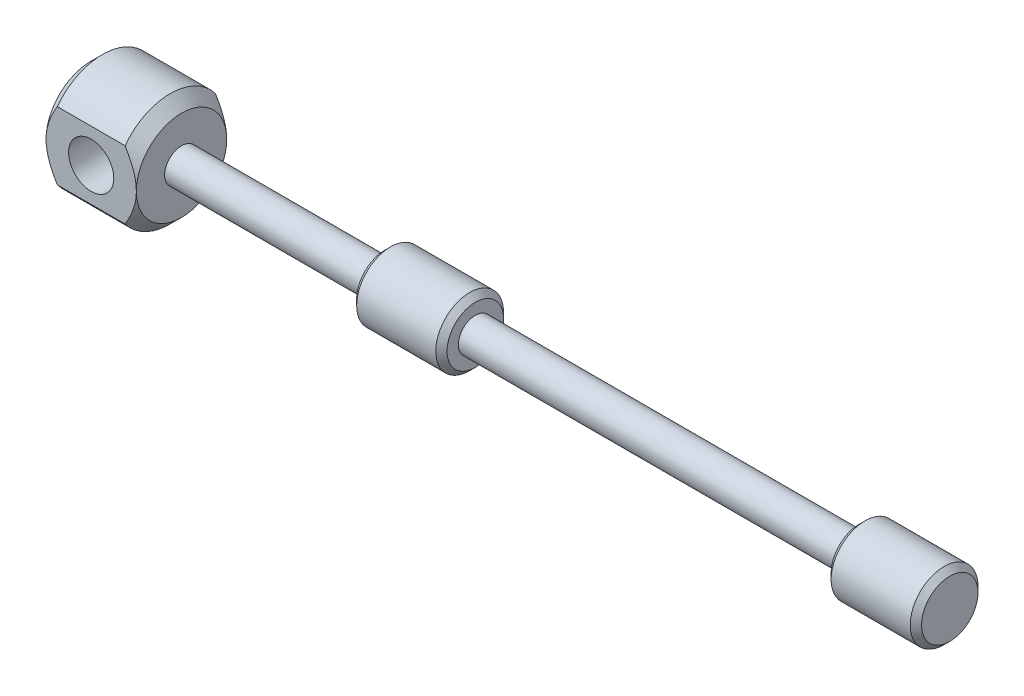
ISO-10303-21;
HEADER;
FILE_DESCRIPTION(('STEP AP214'),'2;1');
FILE_NAME('part.step','',(''),(''),'','','');
FILE_SCHEMA(('AUTOMOTIVE_DESIGN { 1 0 10303 214 1 1 1 1 }'));
ENDSEC;
DATA;
#1=APPLICATION_CONTEXT('core data for automotive mechanical design processes');
#2=APPLICATION_PROTOCOL_DEFINITION('international standard','automotive_design',2000,#1);
#3=PRODUCT_CONTEXT('',#1,'mechanical');
#4=PRODUCT('Part','Part','',(#3));
#5=PRODUCT_RELATED_PRODUCT_CATEGORY('part','',(#4));
#6=PRODUCT_DEFINITION_FORMATION('','',#4);
#7=PRODUCT_DEFINITION_CONTEXT('part definition',#1,'design');
#8=PRODUCT_DEFINITION('design','',#6,#7);
#9=PRODUCT_DEFINITION_SHAPE('','',#8);
#10=(LENGTH_UNIT() NAMED_UNIT(*) SI_UNIT(.MILLI.,.METRE.));
#11=(NAMED_UNIT(*) PLANE_ANGLE_UNIT() SI_UNIT($,.RADIAN.));
#12=(NAMED_UNIT(*) SI_UNIT($,.STERADIAN.) SOLID_ANGLE_UNIT());
#13=UNCERTAINTY_MEASURE_WITH_UNIT(LENGTH_MEASURE(1.E-05),#10,'distance_accuracy_value','');
#14=(GEOMETRIC_REPRESENTATION_CONTEXT(3) GLOBAL_UNCERTAINTY_ASSIGNED_CONTEXT((#13)) GLOBAL_UNIT_ASSIGNED_CONTEXT((#10,
#11,#12)) REPRESENTATION_CONTEXT('',''));
#15=CARTESIAN_POINT('',(0.,0.,0.));
#16=DIRECTION('',(0.,0.,1.));
#17=DIRECTION('',(1.,0.,0.));
#18=AXIS2_PLACEMENT_3D('',#15,#16,#17);
#19=CARTESIAN_POINT('',(-18.,0.,0.));
#20=DIRECTION('',(-1.,0.,0.));
#21=DIRECTION('',(0.,0.,1.));
#22=AXIS2_PLACEMENT_3D('',#19,#20,#21);
#23=CYLINDRICAL_SURFACE('',#22,5.);
#24=DIRECTION('',(-1.,0.,0.));
#25=VECTOR('',#24,1.);
#26=CARTESIAN_POINT('',(-18.,-3.,4.));
#27=LINE('',#26,#25);
#28=CARTESIAN_POINT('',(-25.,-3.,4.));
#29=VERTEX_POINT('',#28);
#30=CARTESIAN_POINT('',(-19.,-3.,4.));
#31=VERTEX_POINT('',#30);
#32=EDGE_CURVE('E195',#29,#31,#27,.F.);
#33=ORIENTED_EDGE('',*,*,#32,.F.);
#34=CARTESIAN_POINT('',(-25.,0.,0.));
#35=DIRECTION('',(-1.,0.,0.));
#36=DIRECTION('',(0.,0.,1.));
#37=AXIS2_PLACEMENT_3D('',#34,#35,#36);
#38=CIRCLE('',#37,5.);
#39=CARTESIAN_POINT('',(-25.,-3.,-4.));
#40=VERTEX_POINT('',#39);
#41=EDGE_CURVE('E125',#29,#40,#38,.F.);
#42=ORIENTED_EDGE('',*,*,#41,.T.);
#43=DIRECTION('',(-1.,0.,0.));
#44=VECTOR('',#43,1.);
#45=CARTESIAN_POINT('',(-18.,-3.,-4.));
#46=LINE('',#45,#44);
#47=CARTESIAN_POINT('',(-19.,-3.,-4.));
#48=VERTEX_POINT('',#47);
#49=EDGE_CURVE('E121',#48,#40,#46,.T.);
#50=ORIENTED_EDGE('',*,*,#49,.F.);
#51=CARTESIAN_POINT('',(-19.,0.,0.));
#52=DIRECTION('',(-1.,0.,0.));
#53=DIRECTION('',(0.,0.,1.));
#54=AXIS2_PLACEMENT_3D('',#51,#52,#53);
#55=CIRCLE('',#54,5.);
#56=EDGE_CURVE('E131',#48,#31,#55,.T.);
#57=ORIENTED_EDGE('',*,*,#56,.T.);
#58=EDGE_LOOP('',(#33,#42,#50,#57));
#59=FACE_BOUND('',#58,.T.);
#60=ADVANCED_FACE('F43',(#59),#23,.T.);
#61=CARTESIAN_POINT('',(-19.,0.,0.));
#62=DIRECTION('',(-1.,0.,0.));
#63=DIRECTION('',(0.,0.,1.));
#64=AXIS2_PLACEMENT_3D('',#61,#62,#63);
#65=CONICAL_SURFACE('',#64,5.,0.78539816339745);
#66=CARTESIAN_POINT('',(-26.7083786113527,-12.0624577482986,4.));
#67=CARTESIAN_POINT('',(-26.5188297905889,-11.8627546869383,4.));
#68=CARTESIAN_POINT('',(-26.3295217080815,-11.6628228735025,4.));
#69=CARTESIAN_POINT('',(-25.9514742317924,-11.2624200659448,4.));
#70=CARTESIAN_POINT('',(-25.7627348415035,-11.0619490685256,4.));
#71=CARTESIAN_POINT('',(-25.1969219126737,-10.4589881443911,4.));
#72=CARTESIAN_POINT('',(-24.8208397845737,-10.055566776886,4.));
#73=CARTESIAN_POINT('',(-24.0508151867542,-9.2220389966232,4.));
#74=CARTESIAN_POINT('',(-23.6570890945255,-8.79173194790588,4.));
#75=CARTESIAN_POINT('',(-23.0714089582689,-8.14242369098127,4.));
#76=CARTESIAN_POINT('',(-22.8771428817277,-7.92550885728903,4.));
#77=CARTESIAN_POINT('',(-22.4905484753912,-7.48996074554231,4.));
#78=CARTESIAN_POINT('',(-22.2982201256968,-7.27132748517601,4.));
#79=CARTESIAN_POINT('',(-21.9164157460658,-6.83237474104771,4.));
#80=CARTESIAN_POINT('',(-21.7269346371567,-6.61205968305024,4.));
#81=CARTESIAN_POINT('',(-21.3511355279373,-6.16871493772407,4.));
#82=CARTESIAN_POINT('',(-21.1648177543667,-5.94568505775477,4.));
#83=CARTESIAN_POINT('',(-20.7955104841441,-5.49506514512524,4.));
#84=CARTESIAN_POINT('',(-20.6125414558073,-5.26745826834511,4.));
#85=CARTESIAN_POINT('',(-20.2524828987245,-4.80770186113664,4.));
#86=CARTESIAN_POINT('',(-20.0753921077954,-4.57555332313911,4.));
#87=CARTESIAN_POINT('',(-19.7343754559407,-4.11182973997455,4.));
#88=CARTESIAN_POINT('',(-19.5702182490867,-3.88042686106083,4.));
#89=CARTESIAN_POINT('',(-19.3324560603645,-3.52740619923417,4.));
#90=CARTESIAN_POINT('',(-19.254570684938,-3.40867456205972,4.));
#91=CARTESIAN_POINT('',(-19.1023331550032,-3.16897373709212,4.));
#92=CARTESIAN_POINT('',(-19.0279807356036,-3.04800471799953,4.));
#93=CARTESIAN_POINT('',(-18.8842200628916,-2.80449264709577,4.));
#94=CARTESIAN_POINT('',(-18.8147757667739,-2.68197111748601,4.));
#95=CARTESIAN_POINT('',(-18.6812169558599,-2.43407010493314,4.));
#96=CARTESIAN_POINT('',(-18.6171033486136,-2.30869013995221,4.));
#97=CARTESIAN_POINT('',(-18.4349291665663,-1.9282499452072,4.));
#98=CARTESIAN_POINT('',(-18.3265917256169,-1.66816723588452,4.));
#99=CARTESIAN_POINT('',(-18.2191247719182,-1.34314416363472,4.));
#100=CARTESIAN_POINT('',(-18.2007813968711,-1.28442357068531,4.));
#101=CARTESIAN_POINT('',(-18.1661993235791,-1.16636535871374,4.));
#102=CARTESIAN_POINT('',(-18.1499605913435,-1.10702774967333,4.));
#103=CARTESIAN_POINT('',(-18.1046366328086,-0.928086236114112,4.));
#104=CARTESIAN_POINT('',(-18.0789566351568,-0.807592301133699,4.));
#105=CARTESIAN_POINT('',(-18.0380217854024,-0.56548422895258,4.));
#106=CARTESIAN_POINT('',(-18.0227127239421,-0.443879337458531,4.));
#107=CARTESIAN_POINT('',(-18.0031394433001,-0.199784405553287,4.));
#108=CARTESIAN_POINT('',(-17.9988735759045,-0.0772944999687434,4.));
#109=CARTESIAN_POINT('',(-18.0016389057871,0.167848695968784,4.));
#110=CARTESIAN_POINT('',(-18.0086971993985,0.290501674447064,4.));
#111=CARTESIAN_POINT('',(-18.033747440004,0.534674536703454,4.));
#112=CARTESIAN_POINT('',(-18.051740045528,0.656194351788074,4.));
#113=CARTESIAN_POINT('',(-18.0978232422,0.897955678626004,4.));
#114=CARTESIAN_POINT('',(-18.1259677950984,1.01818675519311,4.));
#115=CARTESIAN_POINT('',(-18.1910580182415,1.25621830617416,4.));
#116=CARTESIAN_POINT('',(-18.2280042963959,1.37401861209088,4.));
#117=CARTESIAN_POINT('',(-18.314227455947,1.62095994467646,4.));
#118=CARTESIAN_POINT('',(-18.3644515859812,1.74976747194546,4.));
#119=CARTESIAN_POINT('',(-18.4725132394536,2.00415678563646,4.));
#120=CARTESIAN_POINT('',(-18.5303531087453,2.12973756382961,4.));
#121=CARTESIAN_POINT('',(-18.6522625186978,2.37808117662588,4.));
#122=CARTESIAN_POINT('',(-18.7163425332173,2.50083883058347,4.));
#123=CARTESIAN_POINT('',(-18.8494417852055,2.74360867393994,4.));
#124=CARTESIAN_POINT('',(-18.9184603884347,2.86362121327782,4.));
#125=CARTESIAN_POINT('',(-19.0613540684128,3.10267561780306,4.));
#126=CARTESIAN_POINT('',(-19.1352776485702,3.22168835470951,4.));
#127=CARTESIAN_POINT('',(-19.2864566479571,3.45757401085808,4.));
#128=CARTESIAN_POINT('',(-19.3637121458771,3.57444687946963,4.));
#129=CARTESIAN_POINT('',(-19.5208750553998,3.80621965890909,4.));
#130=CARTESIAN_POINT('',(-19.6007797361583,3.92112142685997,4.));
#131=CARTESIAN_POINT('',(-19.7628442949402,4.14931543381093,4.));
#132=CARTESIAN_POINT('',(-19.8450041271492,4.26260770543769,4.));
#133=CARTESIAN_POINT('',(-20.0600993076849,4.55405330424877,4.));
#134=CARTESIAN_POINT('',(-20.1944670942862,4.73114901539809,4.));
#135=CARTESIAN_POINT('',(-20.4668288781397,5.08253610795715,4.));
#136=CARTESIAN_POINT('',(-20.6048231349875,5.25682728716079,4.));
#137=CARTESIAN_POINT('',(-20.8836721496275,5.60316834103965,4.));
#138=CARTESIAN_POINT('',(-21.0245275630072,5.77521768686708,4.));
#139=CARTESIAN_POINT('',(-21.3084933289616,6.11744761107207,4.));
#140=CARTESIAN_POINT('',(-21.4516037323521,6.28762814718928,4.));
#141=CARTESIAN_POINT('',(-21.8840671371319,6.79636946763859,4.));
#142=CARTESIAN_POINT('',(-22.1761369722778,7.13261969048964,4.));
#143=CARTESIAN_POINT('',(-22.7651071722599,7.80075746312115,4.));
#144=CARTESIAN_POINT('',(-23.0620068707926,8.13264560344115,4.));
#145=CARTESIAN_POINT('',(-23.635778285607,8.76727446993551,4.));
#146=CARTESIAN_POINT('',(-23.9123870609033,9.0702532791077,4.));
#147=CARTESIAN_POINT('',(-24.4678393271966,9.67417596353603,4.));
#148=CARTESIAN_POINT('',(-24.7466829109463,9.97511975336563,4.));
#149=CARTESIAN_POINT('',(-25.3052505227485,10.5745218020358,4.));
#150=CARTESIAN_POINT('',(-25.5849694862281,10.8729847855518,4.));
#151=CARTESIAN_POINT('',(-26.1457488871853,11.468613065983,4.));
#152=CARTESIAN_POINT('',(-26.4268092395703,11.7657784429823,4.));
#153=CARTESIAN_POINT('',(-26.7083786113527,12.0624577482986,4.));
#154=B_SPLINE_CURVE_WITH_KNOTS('',3,(#66,#67,#68,#69,#70,#71,#72,#73,#74,#75,#76,#77,#78,#79,
#80,#81,#82,#83,#84,#85,#86,#87,#88,#89,#90,#91,#92,#93,#94,#95,#96,#97,#98,#99,#100,#101,#102,
#103,#104,#105,#106,#107,#108,#109,#110,#111,#112,#113,#114,#115,#116,#117,#118,#119,#120,#121,
#122,#123,#124,#125,#126,#127,#128,#129,#130,#131,#132,#133,#134,#135,#136,#137,#138,#139,#140,
#141,#142,#143,#144,#145,#146,#147,#148,#149,#150,#151,#152,#153),.UNSPECIFIED.,.F.,.F.,(4,2,2,
2,2,2,2,2,2,2,2,2,2,2,2,2,2,2,2,2,2,2,2,2,2,2,2,2,2,2,2,2,2,2,2,2,2,2,2,2,2,2,2,4),(0.,
0.826008831667495,1.65202272622339,3.30660250498125,5.05631577210351,5.92987573731069,
6.80342672249731,7.67516997615031,8.54697545252269,9.42299959235596,10.298834398023,
11.149711499407,11.5756545361928,12.0015655863851,12.4239268279,12.8463598298286,
13.6886904745553,13.8732182156576,14.057742976201,14.426914536783,14.794141215865,
15.1613130826359,15.5293648254607,15.897438736764,16.2674986599569,16.6375841495328,
17.0520374919901,17.4666187972403,17.8819083664013,18.2971446972784,18.7173852210589,
19.137635675168,19.557465627985,19.9772870580984,20.6441217722365,21.3110043515,
21.9780414993579,22.6450937003286,23.9811714943342,25.3170665071073,26.5478146526267,
27.7786141460008,29.0057630179259,30.2328350523182),.UNSPECIFIED.);
#155=CARTESIAN_POINT('',(-18.,0.,4.));
#156=VERTEX_POINT('',#155);
#157=EDGE_CURVE('E194',#31,#156,#154,.T.);
#158=ORIENTED_EDGE('',*,*,#157,.F.);
#159=ORIENTED_EDGE('',*,*,#56,.F.);
#160=CARTESIAN_POINT('',(-26.7083786113527,12.0624577482986,-4.));
#161=CARTESIAN_POINT('',(-26.5188297905889,11.8627546869383,-4.));
#162=CARTESIAN_POINT('',(-26.3295217080815,11.6628228735025,-4.));
#163=CARTESIAN_POINT('',(-25.9514742317924,11.2624200659448,-4.));
#164=CARTESIAN_POINT('',(-25.7627348415035,11.0619490685256,-4.));
#165=CARTESIAN_POINT('',(-25.1969219126737,10.4589881443911,-4.));
#166=CARTESIAN_POINT('',(-24.8208397845737,10.055566776886,-4.));
#167=CARTESIAN_POINT('',(-24.0508151867542,9.2220389966232,-4.));
#168=CARTESIAN_POINT('',(-23.6570890945255,8.79173194790588,-4.));
#169=CARTESIAN_POINT('',(-23.0714089582689,8.14242369098127,-4.));
#170=CARTESIAN_POINT('',(-22.8771428817277,7.92550885728903,-4.));
#171=CARTESIAN_POINT('',(-22.4905484753912,7.48996074554231,-4.));
#172=CARTESIAN_POINT('',(-22.2982201256968,7.27132748517601,-4.));
#173=CARTESIAN_POINT('',(-21.9164157460658,6.83237474104771,-4.));
#174=CARTESIAN_POINT('',(-21.7269346371567,6.61205968305024,-4.));
#175=CARTESIAN_POINT('',(-21.3511355279373,6.16871493772407,-4.));
#176=CARTESIAN_POINT('',(-21.1648177543667,5.94568505775477,-4.));
#177=CARTESIAN_POINT('',(-20.7955104841441,5.49506514512524,-4.));
#178=CARTESIAN_POINT('',(-20.6125414558073,5.26745826834511,-4.));
#179=CARTESIAN_POINT('',(-20.2524828987245,4.80770186113664,-4.));
#180=CARTESIAN_POINT('',(-20.0753921077954,4.57555332313911,-4.));
#181=CARTESIAN_POINT('',(-19.7343754559407,4.11182973997455,-4.));
#182=CARTESIAN_POINT('',(-19.5702182490867,3.88042686106083,-4.));
#183=CARTESIAN_POINT('',(-19.3324560603645,3.52740619923417,-4.));
#184=CARTESIAN_POINT('',(-19.254570684938,3.40867456205972,-4.));
#185=CARTESIAN_POINT('',(-19.1023331550032,3.16897373709212,-4.));
#186=CARTESIAN_POINT('',(-19.0279807356036,3.04800471799953,-4.));
#187=CARTESIAN_POINT('',(-18.8842200628916,2.80449264709577,-4.));
#188=CARTESIAN_POINT('',(-18.8147757667739,2.68197111748601,-4.));
#189=CARTESIAN_POINT('',(-18.6812169558599,2.43407010493314,-4.));
#190=CARTESIAN_POINT('',(-18.6171033486136,2.30869013995221,-4.));
#191=CARTESIAN_POINT('',(-18.4349291665663,1.9282499452072,-4.));
#192=CARTESIAN_POINT('',(-18.3265917256169,1.66816723588452,-4.));
#193=CARTESIAN_POINT('',(-18.2191247719182,1.34314416363472,-4.));
#194=CARTESIAN_POINT('',(-18.2007813968711,1.28442357068531,-4.));
#195=CARTESIAN_POINT('',(-18.1661993235791,1.16636535871374,-4.));
#196=CARTESIAN_POINT('',(-18.1499605913435,1.10702774967333,-4.));
#197=CARTESIAN_POINT('',(-18.1046366328086,0.928086236114112,-4.));
#198=CARTESIAN_POINT('',(-18.0789566351568,0.807592301133699,-4.));
#199=CARTESIAN_POINT('',(-18.0380217854024,0.56548422895258,-4.));
#200=CARTESIAN_POINT('',(-18.0227127239421,0.443879337458531,-4.));
#201=CARTESIAN_POINT('',(-18.0031394433001,0.199784405553287,-4.));
#202=CARTESIAN_POINT('',(-17.9988735759045,0.0772944999687434,-4.));
#203=CARTESIAN_POINT('',(-18.0016389057871,-0.167848695968784,-4.));
#204=CARTESIAN_POINT('',(-18.0086971993985,-0.290501674447064,-4.));
#205=CARTESIAN_POINT('',(-18.033747440004,-0.534674536703454,-4.));
#206=CARTESIAN_POINT('',(-18.051740045528,-0.656194351788074,-4.));
#207=CARTESIAN_POINT('',(-18.0978232422,-0.897955678626004,-4.));
#208=CARTESIAN_POINT('',(-18.1259677950984,-1.01818675519311,-4.));
#209=CARTESIAN_POINT('',(-18.1910580182415,-1.25621830617416,-4.));
#210=CARTESIAN_POINT('',(-18.2280042963959,-1.37401861209088,-4.));
#211=CARTESIAN_POINT('',(-18.314227455947,-1.62095994467646,-4.));
#212=CARTESIAN_POINT('',(-18.3644515859812,-1.74976747194546,-4.));
#213=CARTESIAN_POINT('',(-18.4725132394536,-2.00415678563646,-4.));
#214=CARTESIAN_POINT('',(-18.5303531087453,-2.12973756382961,-4.));
#215=CARTESIAN_POINT('',(-18.6522625186978,-2.37808117662588,-4.));
#216=CARTESIAN_POINT('',(-18.7163425332173,-2.50083883058347,-4.));
#217=CARTESIAN_POINT('',(-18.8494417852055,-2.74360867393994,-4.));
#218=CARTESIAN_POINT('',(-18.9184603884347,-2.86362121327782,-4.));
#219=CARTESIAN_POINT('',(-19.0613540684128,-3.10267561780306,-4.));
#220=CARTESIAN_POINT('',(-19.1352776485702,-3.22168835470951,-4.));
#221=CARTESIAN_POINT('',(-19.2864566479571,-3.45757401085808,-4.));
#222=CARTESIAN_POINT('',(-19.3637121458771,-3.57444687946963,-4.));
#223=CARTESIAN_POINT('',(-19.5208750553998,-3.80621965890909,-4.));
#224=CARTESIAN_POINT('',(-19.6007797361583,-3.92112142685997,-4.));
#225=CARTESIAN_POINT('',(-19.7628442949402,-4.14931543381093,-4.));
#226=CARTESIAN_POINT('',(-19.8450041271492,-4.26260770543769,-4.));
#227=CARTESIAN_POINT('',(-20.0600993076849,-4.55405330424877,-4.));
#228=CARTESIAN_POINT('',(-20.1944670942862,-4.73114901539809,-4.));
#229=CARTESIAN_POINT('',(-20.4668288781397,-5.08253610795715,-4.));
#230=CARTESIAN_POINT('',(-20.6048231349875,-5.25682728716079,-4.));
#231=CARTESIAN_POINT('',(-20.8836721496275,-5.60316834103965,-4.));
#232=CARTESIAN_POINT('',(-21.0245275630072,-5.77521768686708,-4.));
#233=CARTESIAN_POINT('',(-21.3084933289616,-6.11744761107207,-4.));
#234=CARTESIAN_POINT('',(-21.4516037323521,-6.28762814718928,-4.));
#235=CARTESIAN_POINT('',(-21.8840671371319,-6.79636946763859,-4.));
#236=CARTESIAN_POINT('',(-22.1761369722778,-7.13261969048964,-4.));
#237=CARTESIAN_POINT('',(-22.7651071722599,-7.80075746312115,-4.));
#238=CARTESIAN_POINT('',(-23.0620068707926,-8.13264560344115,-4.));
#239=CARTESIAN_POINT('',(-23.635778285607,-8.76727446993551,-4.));
#240=CARTESIAN_POINT('',(-23.9123870609033,-9.0702532791077,-4.));
#241=CARTESIAN_POINT('',(-24.4678393271966,-9.67417596353603,-4.));
#242=CARTESIAN_POINT('',(-24.7466829109463,-9.97511975336563,-4.));
#243=CARTESIAN_POINT('',(-25.3052505227485,-10.5745218020358,-4.));
#244=CARTESIAN_POINT('',(-25.5849694862281,-10.8729847855518,-4.));
#245=CARTESIAN_POINT('',(-26.1457488871853,-11.468613065983,-4.));
#246=CARTESIAN_POINT('',(-26.4268092395703,-11.7657784429823,-4.));
#247=CARTESIAN_POINT('',(-26.7083786113527,-12.0624577482986,-4.));
#248=B_SPLINE_CURVE_WITH_KNOTS('',3,(#160,#161,#162,#163,#164,#165,#166,#167,#168,#169,#170,
#171,#172,#173,#174,#175,#176,#177,#178,#179,#180,#181,#182,#183,#184,#185,#186,#187,#188,#189,
#190,#191,#192,#193,#194,#195,#196,#197,#198,#199,#200,#201,#202,#203,#204,#205,#206,#207,#208,
#209,#210,#211,#212,#213,#214,#215,#216,#217,#218,#219,#220,#221,#222,#223,#224,#225,#226,#227,
#228,#229,#230,#231,#232,#233,#234,#235,#236,#237,#238,#239,#240,#241,#242,#243,#244,#245,#246,
#247),.UNSPECIFIED.,.F.,.F.,(4,2,2,2,2,2,2,2,2,2,2,2,2,2,2,2,2,2,2,2,2,2,2,2,2,2,2,2,2,2,2,2,2,
2,2,2,2,2,2,2,2,2,2,4),(0.,0.826008831667495,1.65202272622339,3.30660250498125,5.05631577210351,
5.92987573731069,6.80342672249731,7.67516997615031,8.54697545252269,9.42299959235596,
10.298834398023,11.149711499407,11.5756545361928,12.0015655863851,12.4239268279,
12.8463598298286,13.6886904745553,13.8732182156576,14.057742976201,14.426914536783,
14.794141215865,15.1613130826359,15.5293648254607,15.897438736764,16.2674986599569,
16.6375841495328,17.0520374919901,17.4666187972403,17.8819083664013,18.2971446972784,
18.7173852210589,19.137635675168,19.557465627985,19.9772870580984,20.6441217722365,
21.3110043515,21.9780414993579,22.6450937003286,23.9811714943342,25.3170665071073,
26.5478146526267,27.7786141460008,29.0057630179259,30.2328350523182),.UNSPECIFIED.);
#249=CARTESIAN_POINT('',(-18.,0.,-4.));
#250=VERTEX_POINT('',#249);
#251=EDGE_CURVE('E120',#250,#48,#248,.T.);
#252=ORIENTED_EDGE('',*,*,#251,.F.);
#253=CARTESIAN_POINT('',(-18.,0.,0.));
#254=DIRECTION('',(-1.,0.,0.));
#255=DIRECTION('',(0.,0.,1.));
#256=AXIS2_PLACEMENT_3D('',#253,#254,#255);
#257=CIRCLE('',#256,3.99999999999998);
#258=EDGE_CURVE('E140',#156,#250,#257,.F.);
#259=ORIENTED_EDGE('',*,*,#258,.F.);
#260=EDGE_LOOP('',(#158,#159,#252,#259));
#261=FACE_BOUND('',#260,.T.);
#262=ADVANCED_FACE('F181',(#261),#65,.T.);
#263=CARTESIAN_POINT('',(-26.,0.,0.));
#264=DIRECTION('',(1.,0.,0.));
#265=DIRECTION('',(0.,0.,-1.));
#266=AXIS2_PLACEMENT_3D('',#263,#264,#265);
#267=CONICAL_SURFACE('',#266,4.,0.78539816339745);
#268=CARTESIAN_POINT('',(-17.2916213886473,12.0624577482986,4.));
#269=CARTESIAN_POINT('',(-17.4811702094111,11.8627546869383,4.));
#270=CARTESIAN_POINT('',(-17.6704782919185,11.6628228735025,4.));
#271=CARTESIAN_POINT('',(-18.0485257682076,11.2624200659448,4.));
#272=CARTESIAN_POINT('',(-18.2372651584965,11.0619490685256,4.));
#273=CARTESIAN_POINT('',(-18.8030780873264,10.4589881443911,4.));
#274=CARTESIAN_POINT('',(-19.1791602154264,10.0555667768859,4.));
#275=CARTESIAN_POINT('',(-19.9491848132459,9.2220389966232,4.));
#276=CARTESIAN_POINT('',(-20.3429109054745,8.79173194790587,4.));
#277=CARTESIAN_POINT('',(-20.9285910417311,8.14242369098126,4.));
#278=CARTESIAN_POINT('',(-21.1228571182724,7.92550885728902,4.));
#279=CARTESIAN_POINT('',(-21.5094515246089,7.4899607455423,4.));
#280=CARTESIAN_POINT('',(-21.7017798743032,7.271327485176,4.));
#281=CARTESIAN_POINT('',(-22.0835842539342,6.8323747410477,4.));
#282=CARTESIAN_POINT('',(-22.2730653628433,6.61205968305023,4.));
#283=CARTESIAN_POINT('',(-22.6488644720627,6.16871493772406,4.));
#284=CARTESIAN_POINT('',(-22.8351822456333,5.94568505775476,4.));
#285=CARTESIAN_POINT('',(-23.204489515856,5.49506514512523,4.));
#286=CARTESIAN_POINT('',(-23.3874585441928,5.2674582683451,4.));
#287=CARTESIAN_POINT('',(-23.7475171012755,4.80770186113663,4.));
#288=CARTESIAN_POINT('',(-23.9246078922046,4.5755533231391,4.));
#289=CARTESIAN_POINT('',(-24.2656245440593,4.11182973997454,4.));
#290=CARTESIAN_POINT('',(-24.4297817509133,3.88042686106083,4.));
#291=CARTESIAN_POINT('',(-24.6675439396355,3.52740619923416,4.));
#292=CARTESIAN_POINT('',(-24.745429315062,3.40867456205971,4.));
#293=CARTESIAN_POINT('',(-24.8976668449968,3.16897373709211,4.));
#294=CARTESIAN_POINT('',(-24.9720192643964,3.04800471799952,4.));
#295=CARTESIAN_POINT('',(-25.1157799371085,2.80449264709576,4.));
#296=CARTESIAN_POINT('',(-25.1852242332261,2.681971117486,4.));
#297=CARTESIAN_POINT('',(-25.3187830441401,2.43407010493312,4.));
#298=CARTESIAN_POINT('',(-25.3828966513864,2.30869013995219,4.));
#299=CARTESIAN_POINT('',(-25.5650708334337,1.92824994520718,4.));
#300=CARTESIAN_POINT('',(-25.6734082743832,1.6681672358845,4.));
#301=CARTESIAN_POINT('',(-25.7808752280818,1.3431441636347,4.));
#302=CARTESIAN_POINT('',(-25.7992186031289,1.2844235706853,4.));
#303=CARTESIAN_POINT('',(-25.8338006764209,1.16636535871372,4.));
#304=CARTESIAN_POINT('',(-25.8500394086565,1.10702774967331,4.));
#305=CARTESIAN_POINT('',(-25.8953633671914,0.928086236114094,4.));
#306=CARTESIAN_POINT('',(-25.9210433648432,0.807592301133681,4.));
#307=CARTESIAN_POINT('',(-25.9619782145976,0.565484228952561,4.));
#308=CARTESIAN_POINT('',(-25.9772872760579,0.443879337458511,4.));
#309=CARTESIAN_POINT('',(-25.9968605567,0.199784405553268,4.));
#310=CARTESIAN_POINT('',(-26.0011264240955,0.0772944999687244,4.));
#311=CARTESIAN_POINT('',(-25.9983610942129,-0.167848695968802,4.));
#312=CARTESIAN_POINT('',(-25.9913028006016,-0.290501674447082,4.));
#313=CARTESIAN_POINT('',(-25.966252559996,-0.53467453670347,4.));
#314=CARTESIAN_POINT('',(-25.948259954472,-0.656194351788091,4.));
#315=CARTESIAN_POINT('',(-25.9021767578,-0.897955678626021,4.));
#316=CARTESIAN_POINT('',(-25.8740322049016,-1.01818675519313,4.));
#317=CARTESIAN_POINT('',(-25.8089419817585,-1.25621830617418,4.));
#318=CARTESIAN_POINT('',(-25.7719957036041,-1.3740186120909,4.));
#319=CARTESIAN_POINT('',(-25.685772544053,-1.62095994467647,4.));
#320=CARTESIAN_POINT('',(-25.6355484140188,-1.74976747194548,4.));
#321=CARTESIAN_POINT('',(-25.5274867605464,-2.00415678563648,4.));
#322=CARTESIAN_POINT('',(-25.4696468912547,-2.12973756382963,4.));
#323=CARTESIAN_POINT('',(-25.3477374813022,-2.37808117662591,4.));
#324=CARTESIAN_POINT('',(-25.2836574667827,-2.5008388305835,4.));
#325=CARTESIAN_POINT('',(-25.1505582147945,-2.74360867393997,4.));
#326=CARTESIAN_POINT('',(-25.0815396115653,-2.86362121327785,4.));
#327=CARTESIAN_POINT('',(-24.9386459315872,-3.10267561780309,4.));
#328=CARTESIAN_POINT('',(-24.8647223514298,-3.22168835470954,4.));
#329=CARTESIAN_POINT('',(-24.7135433520429,-3.45757401085812,4.));
#330=CARTESIAN_POINT('',(-24.6362878541229,-3.57444687946967,4.));
#331=CARTESIAN_POINT('',(-24.4791249446001,-3.80621965890913,4.));
#332=CARTESIAN_POINT('',(-24.3992202638416,-3.92112142686001,4.));
#333=CARTESIAN_POINT('',(-24.2371557050598,-4.14931543381097,4.));
#334=CARTESIAN_POINT('',(-24.1549958728507,-4.26260770543773,4.));
#335=CARTESIAN_POINT('',(-23.9399006923151,-4.55405330424881,4.));
#336=CARTESIAN_POINT('',(-23.8055329057138,-4.73114901539813,4.));
#337=CARTESIAN_POINT('',(-23.5331711218603,-5.08253610795719,4.));
#338=CARTESIAN_POINT('',(-23.3951768650125,-5.25682728716083,4.));
#339=CARTESIAN_POINT('',(-23.1163278503725,-5.60316834103968,4.));
#340=CARTESIAN_POINT('',(-22.9754724369928,-5.77521768686711,4.));
#341=CARTESIAN_POINT('',(-22.6915066710384,-6.1174476110721,4.));
#342=CARTESIAN_POINT('',(-22.5483962676479,-6.28762814718931,4.));
#343=CARTESIAN_POINT('',(-22.1159328628681,-6.79636946763862,4.));
#344=CARTESIAN_POINT('',(-21.8238630277222,-7.13261969048966,4.));
#345=CARTESIAN_POINT('',(-21.2348928277401,-7.80075746312117,4.));
#346=CARTESIAN_POINT('',(-20.9379931292074,-8.13264560344117,4.));
#347=CARTESIAN_POINT('',(-20.364221714393,-8.76727446993552,4.));
#348=CARTESIAN_POINT('',(-20.0876129390967,-9.07025327910771,4.));
#349=CARTESIAN_POINT('',(-19.5321606728034,-9.67417596353604,4.));
#350=CARTESIAN_POINT('',(-19.2533170890537,-9.97511975336564,4.));
#351=CARTESIAN_POINT('',(-18.6947494772515,-10.5745218020358,4.));
#352=CARTESIAN_POINT('',(-18.4150305137719,-10.8729847855518,4.));
#353=CARTESIAN_POINT('',(-17.8542511128147,-11.468613065983,4.));
#354=CARTESIAN_POINT('',(-17.5731907604297,-11.7657784429823,4.));
#355=CARTESIAN_POINT('',(-17.2916213886473,-12.0624577482986,4.));
#356=B_SPLINE_CURVE_WITH_KNOTS('',3,(#268,#269,#270,#271,#272,#273,#274,#275,#276,#277,#278,
#279,#280,#281,#282,#283,#284,#285,#286,#287,#288,#289,#290,#291,#292,#293,#294,#295,#296,#297,
#298,#299,#300,#301,#302,#303,#304,#305,#306,#307,#308,#309,#310,#311,#312,#313,#314,#315,#316,
#317,#318,#319,#320,#321,#322,#323,#324,#325,#326,#327,#328,#329,#330,#331,#332,#333,#334,#335,
#336,#337,#338,#339,#340,#341,#342,#343,#344,#345,#346,#347,#348,#349,#350,#351,#352,#353,#354,
#355),.UNSPECIFIED.,.F.,.F.,(4,2,2,2,2,2,2,2,2,2,2,2,2,2,2,2,2,2,2,2,2,2,2,2,2,2,2,2,2,2,2,2,2,
2,2,2,2,2,2,2,2,2,2,4),(0.,0.826008831667496,1.65202272622339,3.30660250498125,5.05631577210352,
5.9298757373107,6.80342672249732,7.67516997615032,8.5469754525227,9.42299959235597,
10.298834398023,11.149711499407,11.5756545361928,12.0015655863851,12.4239268279001,
12.8463598298286,13.6886904745553,13.8732182156576,14.057742976201,14.426914536783,
14.794141215865,15.1613130826359,15.5293648254607,15.897438736764,16.2674986599569,
16.6375841495328,17.0520374919901,17.4666187972404,17.8819083664013,18.2971446972785,
18.7173852210589,19.137635675168,19.557465627985,19.9772870580984,20.6441217722365,
21.3110043515001,21.9780414993579,22.6450937003286,23.9811714943342,25.3170665071074,
26.5478146526267,27.7786141460008,29.0057630179259,30.2328350523182),.UNSPECIFIED.);
#357=CARTESIAN_POINT('',(-25.,3.,4.));
#358=VERTEX_POINT('',#357);
#359=CARTESIAN_POINT('',(-26.,0.,4.));
#360=VERTEX_POINT('',#359);
#361=EDGE_CURVE('E11',#358,#360,#356,.T.);
#362=ORIENTED_EDGE('',*,*,#361,.F.);
#363=CARTESIAN_POINT('',(-25.,3.,-4.));
#364=VERTEX_POINT('',#363);
#365=EDGE_CURVE('E116',#364,#358,#38,.F.);
#366=ORIENTED_EDGE('',*,*,#365,.F.);
#367=CARTESIAN_POINT('',(-17.2916213886473,-12.0624577482986,-4.));
#368=CARTESIAN_POINT('',(-17.4811702094111,-11.8627546869383,-4.));
#369=CARTESIAN_POINT('',(-17.6704782919185,-11.6628228735025,-4.));
#370=CARTESIAN_POINT('',(-18.0485257682076,-11.2624200659448,-4.));
#371=CARTESIAN_POINT('',(-18.2372651584965,-11.0619490685256,-4.));
#372=CARTESIAN_POINT('',(-18.8030780873264,-10.4589881443911,-4.));
#373=CARTESIAN_POINT('',(-19.1791602154264,-10.0555667768859,-4.));
#374=CARTESIAN_POINT('',(-19.9491848132459,-9.2220389966232,-4.));
#375=CARTESIAN_POINT('',(-20.3429109054745,-8.79173194790587,-4.));
#376=CARTESIAN_POINT('',(-20.9285910417311,-8.14242369098126,-4.));
#377=CARTESIAN_POINT('',(-21.1228571182724,-7.92550885728902,-4.));
#378=CARTESIAN_POINT('',(-21.5094515246089,-7.4899607455423,-4.));
#379=CARTESIAN_POINT('',(-21.7017798743032,-7.271327485176,-4.));
#380=CARTESIAN_POINT('',(-22.0835842539342,-6.8323747410477,-4.));
#381=CARTESIAN_POINT('',(-22.2730653628433,-6.61205968305023,-4.));
#382=CARTESIAN_POINT('',(-22.6488644720627,-6.16871493772406,-4.));
#383=CARTESIAN_POINT('',(-22.8351822456333,-5.94568505775476,-4.));
#384=CARTESIAN_POINT('',(-23.204489515856,-5.49506514512523,-4.));
#385=CARTESIAN_POINT('',(-23.3874585441928,-5.2674582683451,-4.));
#386=CARTESIAN_POINT('',(-23.7475171012755,-4.80770186113663,-4.));
#387=CARTESIAN_POINT('',(-23.9246078922046,-4.5755533231391,-4.));
#388=CARTESIAN_POINT('',(-24.2656245440593,-4.11182973997454,-4.));
#389=CARTESIAN_POINT('',(-24.4297817509133,-3.88042686106083,-4.));
#390=CARTESIAN_POINT('',(-24.6675439396355,-3.52740619923416,-4.));
#391=CARTESIAN_POINT('',(-24.745429315062,-3.40867456205971,-4.));
#392=CARTESIAN_POINT('',(-24.8976668449968,-3.16897373709211,-4.));
#393=CARTESIAN_POINT('',(-24.9720192643964,-3.04800471799952,-4.));
#394=CARTESIAN_POINT('',(-25.1157799371085,-2.80449264709576,-4.));
#395=CARTESIAN_POINT('',(-25.1852242332261,-2.681971117486,-4.));
#396=CARTESIAN_POINT('',(-25.3187830441401,-2.43407010493312,-4.));
#397=CARTESIAN_POINT('',(-25.3828966513864,-2.30869013995219,-4.));
#398=CARTESIAN_POINT('',(-25.5650708334337,-1.92824994520718,-4.));
#399=CARTESIAN_POINT('',(-25.6734082743832,-1.6681672358845,-4.));
#400=CARTESIAN_POINT('',(-25.7808752280818,-1.3431441636347,-4.));
#401=CARTESIAN_POINT('',(-25.7992186031289,-1.2844235706853,-4.));
#402=CARTESIAN_POINT('',(-25.8338006764209,-1.16636535871372,-4.));
#403=CARTESIAN_POINT('',(-25.8500394086565,-1.10702774967331,-4.));
#404=CARTESIAN_POINT('',(-25.8953633671914,-0.928086236114094,-4.));
#405=CARTESIAN_POINT('',(-25.9210433648432,-0.807592301133681,-4.));
#406=CARTESIAN_POINT('',(-25.9619782145976,-0.565484228952561,-4.));
#407=CARTESIAN_POINT('',(-25.9772872760579,-0.443879337458511,-4.));
#408=CARTESIAN_POINT('',(-25.9968605567,-0.199784405553268,-4.));
#409=CARTESIAN_POINT('',(-26.0011264240955,-0.0772944999687244,-4.));
#410=CARTESIAN_POINT('',(-25.9983610942129,0.167848695968802,-4.));
#411=CARTESIAN_POINT('',(-25.9913028006016,0.290501674447082,-4.));
#412=CARTESIAN_POINT('',(-25.966252559996,0.53467453670347,-4.));
#413=CARTESIAN_POINT('',(-25.948259954472,0.656194351788091,-4.));
#414=CARTESIAN_POINT('',(-25.9021767578,0.897955678626021,-4.));
#415=CARTESIAN_POINT('',(-25.8740322049016,1.01818675519313,-4.));
#416=CARTESIAN_POINT('',(-25.8089419817585,1.25621830617418,-4.));
#417=CARTESIAN_POINT('',(-25.7719957036041,1.3740186120909,-4.));
#418=CARTESIAN_POINT('',(-25.685772544053,1.62095994467647,-4.));
#419=CARTESIAN_POINT('',(-25.6355484140188,1.74976747194548,-4.));
#420=CARTESIAN_POINT('',(-25.5274867605464,2.00415678563648,-4.));
#421=CARTESIAN_POINT('',(-25.4696468912547,2.12973756382963,-4.));
#422=CARTESIAN_POINT('',(-25.3477374813022,2.37808117662591,-4.));
#423=CARTESIAN_POINT('',(-25.2836574667827,2.5008388305835,-4.));
#424=CARTESIAN_POINT('',(-25.1505582147945,2.74360867393997,-4.));
#425=CARTESIAN_POINT('',(-25.0815396115653,2.86362121327785,-4.));
#426=CARTESIAN_POINT('',(-24.9386459315872,3.10267561780309,-4.));
#427=CARTESIAN_POINT('',(-24.8647223514298,3.22168835470954,-4.));
#428=CARTESIAN_POINT('',(-24.7135433520429,3.45757401085812,-4.));
#429=CARTESIAN_POINT('',(-24.6362878541229,3.57444687946967,-4.));
#430=CARTESIAN_POINT('',(-24.4791249446001,3.80621965890913,-4.));
#431=CARTESIAN_POINT('',(-24.3992202638416,3.92112142686001,-4.));
#432=CARTESIAN_POINT('',(-24.2371557050598,4.14931543381097,-4.));
#433=CARTESIAN_POINT('',(-24.1549958728507,4.26260770543773,-4.));
#434=CARTESIAN_POINT('',(-23.9399006923151,4.55405330424881,-4.));
#435=CARTESIAN_POINT('',(-23.8055329057138,4.73114901539813,-4.));
#436=CARTESIAN_POINT('',(-23.5331711218603,5.08253610795719,-4.));
#437=CARTESIAN_POINT('',(-23.3951768650125,5.25682728716083,-4.));
#438=CARTESIAN_POINT('',(-23.1163278503725,5.60316834103968,-4.));
#439=CARTESIAN_POINT('',(-22.9754724369928,5.77521768686711,-4.));
#440=CARTESIAN_POINT('',(-22.6915066710384,6.1174476110721,-4.));
#441=CARTESIAN_POINT('',(-22.5483962676479,6.28762814718931,-4.));
#442=CARTESIAN_POINT('',(-22.1159328628681,6.79636946763862,-4.));
#443=CARTESIAN_POINT('',(-21.8238630277222,7.13261969048966,-4.));
#444=CARTESIAN_POINT('',(-21.2348928277401,7.80075746312117,-4.));
#445=CARTESIAN_POINT('',(-20.9379931292074,8.13264560344117,-4.));
#446=CARTESIAN_POINT('',(-20.364221714393,8.76727446993552,-4.));
#447=CARTESIAN_POINT('',(-20.0876129390967,9.07025327910771,-4.));
#448=CARTESIAN_POINT('',(-19.5321606728034,9.67417596353604,-4.));
#449=CARTESIAN_POINT('',(-19.2533170890537,9.97511975336564,-4.));
#450=CARTESIAN_POINT('',(-18.6947494772515,10.5745218020358,-4.));
#451=CARTESIAN_POINT('',(-18.4150305137719,10.8729847855518,-4.));
#452=CARTESIAN_POINT('',(-17.8542511128147,11.468613065983,-4.));
#453=CARTESIAN_POINT('',(-17.5731907604297,11.7657784429823,-4.));
#454=CARTESIAN_POINT('',(-17.2916213886473,12.0624577482986,-4.));
#455=B_SPLINE_CURVE_WITH_KNOTS('',3,(#367,#368,#369,#370,#371,#372,#373,#374,#375,#376,#377,
#378,#379,#380,#381,#382,#383,#384,#385,#386,#387,#388,#389,#390,#391,#392,#393,#394,#395,#396,
#397,#398,#399,#400,#401,#402,#403,#404,#405,#406,#407,#408,#409,#410,#411,#412,#413,#414,#415,
#416,#417,#418,#419,#420,#421,#422,#423,#424,#425,#426,#427,#428,#429,#430,#431,#432,#433,#434,
#435,#436,#437,#438,#439,#440,#441,#442,#443,#444,#445,#446,#447,#448,#449,#450,#451,#452,#453,
#454),.UNSPECIFIED.,.F.,.F.,(4,2,2,2,2,2,2,2,2,2,2,2,2,2,2,2,2,2,2,2,2,2,2,2,2,2,2,2,2,2,2,2,2,
2,2,2,2,2,2,2,2,2,2,4),(0.,0.826008831667496,1.65202272622339,3.30660250498125,5.05631577210352,
5.9298757373107,6.80342672249732,7.67516997615032,8.5469754525227,9.42299959235597,
10.298834398023,11.149711499407,11.5756545361928,12.0015655863851,12.4239268279001,
12.8463598298286,13.6886904745553,13.8732182156576,14.057742976201,14.426914536783,
14.794141215865,15.1613130826359,15.5293648254607,15.897438736764,16.2674986599569,
16.6375841495328,17.0520374919901,17.4666187972404,17.8819083664013,18.2971446972785,
18.7173852210589,19.137635675168,19.557465627985,19.9772870580984,20.6441217722365,
21.3110043515001,21.9780414993579,22.6450937003286,23.9811714943342,25.3170665071074,
26.5478146526267,27.7786141460008,29.0057630179259,30.2328350523182),.UNSPECIFIED.);
#456=CARTESIAN_POINT('',(-26.,0.,-4.));
#457=VERTEX_POINT('',#456);
#458=EDGE_CURVE('E99',#457,#364,#455,.T.);
#459=ORIENTED_EDGE('',*,*,#458,.F.);
#460=CARTESIAN_POINT('',(-26.,0.,0.));
#461=DIRECTION('',(-1.,0.,0.));
#462=DIRECTION('',(0.,0.,1.));
#463=AXIS2_PLACEMENT_3D('',#460,#461,#462);
#464=CIRCLE('',#463,4.);
#465=EDGE_CURVE('E110',#360,#457,#464,.T.);
#466=ORIENTED_EDGE('',*,*,#465,.F.);
#467=EDGE_LOOP('',(#362,#366,#459,#466));
#468=FACE_BOUND('',#467,.T.);
#469=ADVANCED_FACE('F123',(#468),#267,.T.);
#470=CARTESIAN_POINT('',(-26.,0.,0.));
#471=DIRECTION('',(1.,0.,0.));
#472=DIRECTION('',(0.,0.,-1.));
#473=AXIS2_PLACEMENT_3D('',#470,#471,#472);
#474=CYLINDRICAL_SURFACE('',#473,1.5);
#475=CARTESIAN_POINT('',(0.,0.,0.));
#476=DIRECTION('',(-1.,0.,0.));
#477=DIRECTION('',(0.,0.,1.));
#478=AXIS2_PLACEMENT_3D('',#475,#476,#477);
#479=CIRCLE('',#478,1.5);
#480=CARTESIAN_POINT('',(0.,0.,1.5));
#481=VERTEX_POINT('',#480);
#482=EDGE_CURVE('E133',#481,#481,#479,.T.);
#483=ORIENTED_EDGE('',*,*,#482,.T.);
#484=EDGE_LOOP('',(#483));
#485=FACE_BOUND('',#484,.T.);
#486=CARTESIAN_POINT('',(-18.,0.,0.));
#487=DIRECTION('',(-1.,0.,0.));
#488=DIRECTION('',(0.,0.,1.));
#489=AXIS2_PLACEMENT_3D('',#486,#487,#488);
#490=CIRCLE('',#489,1.5);
#491=CARTESIAN_POINT('',(-18.,0.,1.5));
#492=VERTEX_POINT('',#491);
#493=EDGE_CURVE('E126',#492,#492,#490,.T.);
#494=ORIENTED_EDGE('',*,*,#493,.F.);
#495=EDGE_LOOP('',(#494));
#496=FACE_BOUND('',#495,.T.);
#497=ADVANCED_FACE('F267',(#485,#496),#474,.T.);
#498=CARTESIAN_POINT('',(50.,0.,0.));
#499=DIRECTION('',(-1.,0.,0.));
#500=DIRECTION('',(0.,0.,1.));
#501=AXIS2_PLACEMENT_3D('',#498,#499,#500);
#502=CYLINDRICAL_SURFACE('',#501,1.5);
#503=CARTESIAN_POINT('',(42.,0.,0.));
#504=DIRECTION('',(1.,0.,0.));
#505=DIRECTION('',(0.,0.,-1.));
#506=AXIS2_PLACEMENT_3D('',#503,#504,#505);
#507=CIRCLE('',#506,1.5);
#508=CARTESIAN_POINT('',(42.,0.,-1.5));
#509=VERTEX_POINT('',#508);
#510=EDGE_CURVE('E200',#509,#509,#507,.T.);
#511=ORIENTED_EDGE('',*,*,#510,.F.);
#512=EDGE_LOOP('',(#511));
#513=FACE_BOUND('',#512,.T.);
#514=CARTESIAN_POINT('',(8.,0.,0.));
#515=DIRECTION('',(-1.,0.,0.));
#516=DIRECTION('',(0.,0.,1.));
#517=AXIS2_PLACEMENT_3D('',#514,#515,#516);
#518=CIRCLE('',#517,1.5);
#519=CARTESIAN_POINT('',(8.,0.,1.5));
#520=VERTEX_POINT('',#519);
#521=EDGE_CURVE('E224',#520,#520,#518,.T.);
#522=ORIENTED_EDGE('',*,*,#521,.F.);
#523=EDGE_LOOP('',(#522));
#524=FACE_BOUND('',#523,.T.);
#525=ADVANCED_FACE('F270',(#513,#524),#502,.T.);
#526=CARTESIAN_POINT('',(42.,0.,0.));
#527=DIRECTION('',(1.,0.,0.));
#528=DIRECTION('',(0.,0.,-1.));
#529=AXIS2_PLACEMENT_3D('',#526,#527,#528);
#530=CYLINDRICAL_SURFACE('',#529,3.);
#531=CARTESIAN_POINT('',(42.5,0.,0.));
#532=DIRECTION('',(1.,0.,0.));
#533=DIRECTION('',(0.,0.,-1.));
#534=AXIS2_PLACEMENT_3D('',#531,#532,#533);
#535=CIRCLE('',#534,3.);
#536=CARTESIAN_POINT('',(42.5,0.,-3.));
#537=VERTEX_POINT('',#536);
#538=EDGE_CURVE('E212',#537,#537,#535,.T.);
#539=ORIENTED_EDGE('',*,*,#538,.T.);
#540=EDGE_LOOP('',(#539));
#541=FACE_BOUND('',#540,.T.);
#542=CARTESIAN_POINT('',(49.5,0.,0.));
#543=DIRECTION('',(1.,0.,0.));
#544=DIRECTION('',(0.,0.,-1.));
#545=AXIS2_PLACEMENT_3D('',#542,#543,#544);
#546=CIRCLE('',#545,3.);
#547=CARTESIAN_POINT('',(49.5,0.,-3.));
#548=VERTEX_POINT('',#547);
#549=EDGE_CURVE('E208',#548,#548,#546,.F.);
#550=ORIENTED_EDGE('',*,*,#549,.T.);
#551=EDGE_LOOP('',(#550));
#552=FACE_BOUND('',#551,.T.);
#553=ADVANCED_FACE('F285',(#541,#552),#530,.T.);
#554=CARTESIAN_POINT('',(42.,0.,0.));
#555=DIRECTION('',(1.,0.,0.));
#556=DIRECTION('',(0.,0.,-1.));
#557=AXIS2_PLACEMENT_3D('',#554,#555,#556);
#558=PLANE('',#557);
#559=CARTESIAN_POINT('',(42.,0.,0.));
#560=DIRECTION('',(1.,0.,0.));
#561=DIRECTION('',(0.,0.,-1.));
#562=AXIS2_PLACEMENT_3D('',#559,#560,#561);
#563=CIRCLE('',#562,2.5);
#564=CARTESIAN_POINT('',(42.,0.,-2.5));
#565=VERTEX_POINT('',#564);
#566=EDGE_CURVE('E216',#565,#565,#563,.F.);
#567=ORIENTED_EDGE('',*,*,#566,.T.);
#568=EDGE_LOOP('',(#567));
#569=FACE_BOUND('',#568,.T.);
#570=ORIENTED_EDGE('',*,*,#510,.T.);
#571=EDGE_LOOP('',(#570));
#572=FACE_BOUND('',#571,.T.);
#573=ADVANCED_FACE('F281',(#569,#572),#558,.F.);
#574=CARTESIAN_POINT('',(50.,0.,0.));
#575=DIRECTION('',(1.,0.,0.));
#576=DIRECTION('',(0.,0.,-1.));
#577=AXIS2_PLACEMENT_3D('',#574,#575,#576);
#578=PLANE('',#577);
#579=CARTESIAN_POINT('',(50.,0.,0.));
#580=DIRECTION('',(1.,0.,0.));
#581=DIRECTION('',(0.,0.,-1.));
#582=AXIS2_PLACEMENT_3D('',#579,#580,#581);
#583=CIRCLE('',#582,2.49999999999999);
#584=CARTESIAN_POINT('',(50.,0.,-2.49999999999999));
#585=VERTEX_POINT('',#584);
#586=EDGE_CURVE('E220',#585,#585,#583,.T.);
#587=ORIENTED_EDGE('',*,*,#586,.T.);
#588=EDGE_LOOP('',(#587));
#589=FACE_BOUND('',#588,.T.);
#590=ADVANCED_FACE('F284',(#589),#578,.T.);
#591=CARTESIAN_POINT('',(42.5,0.,0.));
#592=DIRECTION('',(1.,0.,0.));
#593=DIRECTION('',(0.,0.,-1.));
#594=AXIS2_PLACEMENT_3D('',#591,#592,#593);
#595=CONICAL_SURFACE('',#594,3.,0.785398163397446);
#596=ORIENTED_EDGE('',*,*,#566,.F.);
#597=EDGE_LOOP('',(#596));
#598=FACE_BOUND('',#597,.T.);
#599=ORIENTED_EDGE('',*,*,#538,.F.);
#600=EDGE_LOOP('',(#599));
#601=FACE_BOUND('',#600,.T.);
#602=ADVANCED_FACE('F292',(#598,#601),#595,.T.);
#603=CARTESIAN_POINT('',(50.,0.,0.));
#604=DIRECTION('',(-1.,0.,0.));
#605=DIRECTION('',(0.,0.,1.));
#606=AXIS2_PLACEMENT_3D('',#603,#604,#605);
#607=CONICAL_SURFACE('',#606,2.49999999999999,0.785398163397446);
#608=ORIENTED_EDGE('',*,*,#549,.F.);
#609=EDGE_LOOP('',(#608));
#610=FACE_BOUND('',#609,.T.);
#611=ORIENTED_EDGE('',*,*,#586,.F.);
#612=EDGE_LOOP('',(#611));
#613=FACE_BOUND('',#612,.T.);
#614=ADVANCED_FACE('F279',(#610,#613),#607,.T.);
#615=CARTESIAN_POINT('',(8.,0.,0.));
#616=DIRECTION('',(-1.,0.,0.));
#617=DIRECTION('',(0.,0.,1.));
#618=AXIS2_PLACEMENT_3D('',#615,#616,#617);
#619=CYLINDRICAL_SURFACE('',#618,3.);
#620=CARTESIAN_POINT('',(7.5,0.,0.));
#621=DIRECTION('',(-1.,0.,0.));
#622=DIRECTION('',(0.,0.,1.));
#623=AXIS2_PLACEMENT_3D('',#620,#621,#622);
#624=CIRCLE('',#623,3.);
#625=CARTESIAN_POINT('',(7.5,0.,3.));
#626=VERTEX_POINT('',#625);
#627=EDGE_CURVE('E232',#626,#626,#624,.T.);
#628=ORIENTED_EDGE('',*,*,#627,.T.);
#629=EDGE_LOOP('',(#628));
#630=FACE_BOUND('',#629,.T.);
#631=CARTESIAN_POINT('',(0.500000000000016,0.,0.));
#632=DIRECTION('',(1.,0.,0.));
#633=DIRECTION('',(0.,0.,-1.));
#634=AXIS2_PLACEMENT_3D('',#631,#632,#633);
#635=CIRCLE('',#634,3.);
#636=CARTESIAN_POINT('',(0.500000000000016,0.,-3.));
#637=VERTEX_POINT('',#636);
#638=EDGE_CURVE('E228',#637,#637,#635,.T.);
#639=ORIENTED_EDGE('',*,*,#638,.T.);
#640=EDGE_LOOP('',(#639));
#641=FACE_BOUND('',#640,.T.);
#642=ADVANCED_FACE('F275',(#630,#641),#619,.T.);
#643=CARTESIAN_POINT('',(8.,0.,0.));
#644=DIRECTION('',(-1.,0.,0.));
#645=DIRECTION('',(0.,0.,1.));
#646=AXIS2_PLACEMENT_3D('',#643,#644,#645);
#647=PLANE('',#646);
#648=CARTESIAN_POINT('',(8.,0.,0.));
#649=DIRECTION('',(-1.,0.,0.));
#650=DIRECTION('',(0.,0.,1.));
#651=AXIS2_PLACEMENT_3D('',#648,#649,#650);
#652=CIRCLE('',#651,2.5);
#653=CARTESIAN_POINT('',(8.,0.,2.5));
#654=VERTEX_POINT('',#653);
#655=EDGE_CURVE('E236',#654,#654,#652,.F.);
#656=ORIENTED_EDGE('',*,*,#655,.T.);
#657=EDGE_LOOP('',(#656));
#658=FACE_BOUND('',#657,.T.);
#659=ORIENTED_EDGE('',*,*,#521,.T.);
#660=EDGE_LOOP('',(#659));
#661=FACE_BOUND('',#660,.T.);
#662=ADVANCED_FACE('F272',(#658,#661),#647,.F.);
#663=CARTESIAN_POINT('',(0.,0.,0.));
#664=DIRECTION('',(1.,0.,0.));
#665=DIRECTION('',(0.,0.,-1.));
#666=AXIS2_PLACEMENT_3D('',#663,#664,#665);
#667=PLANE('',#666);
#668=ORIENTED_EDGE('',*,*,#482,.F.);
#669=EDGE_LOOP('',(#668));
#670=FACE_BOUND('',#669,.T.);
#671=CARTESIAN_POINT('',(0.,0.,0.));
#672=DIRECTION('',(1.,0.,0.));
#673=DIRECTION('',(0.,0.,-1.));
#674=AXIS2_PLACEMENT_3D('',#671,#672,#673);
#675=CIRCLE('',#674,2.49999999999999);
#676=CARTESIAN_POINT('',(0.,0.,-2.49999999999999));
#677=VERTEX_POINT('',#676);
#678=EDGE_CURVE('E204',#677,#677,#675,.F.);
#679=ORIENTED_EDGE('',*,*,#678,.T.);
#680=EDGE_LOOP('',(#679));
#681=FACE_BOUND('',#680,.T.);
#682=ADVANCED_FACE('F243',(#670,#681),#667,.F.);
#683=CARTESIAN_POINT('',(7.5,0.,0.));
#684=DIRECTION('',(-1.,0.,0.));
#685=DIRECTION('',(0.,0.,1.));
#686=AXIS2_PLACEMENT_3D('',#683,#684,#685);
#687=CONICAL_SURFACE('',#686,3.,0.785398163397445);
#688=ORIENTED_EDGE('',*,*,#655,.F.);
#689=EDGE_LOOP('',(#688));
#690=FACE_BOUND('',#689,.T.);
#691=ORIENTED_EDGE('',*,*,#627,.F.);
#692=EDGE_LOOP('',(#691));
#693=FACE_BOUND('',#692,.T.);
#694=ADVANCED_FACE('F246',(#690,#693),#687,.T.);
#695=CARTESIAN_POINT('',(0.,0.,0.));
#696=DIRECTION('',(1.,0.,0.));
#697=DIRECTION('',(0.,0.,-1.));
#698=AXIS2_PLACEMENT_3D('',#695,#696,#697);
#699=CONICAL_SURFACE('',#698,2.49999999999999,0.785398163397444);
#700=ORIENTED_EDGE('',*,*,#638,.F.);
#701=EDGE_LOOP('',(#700));
#702=FACE_BOUND('',#701,.T.);
#703=ORIENTED_EDGE('',*,*,#678,.F.);
#704=EDGE_LOOP('',(#703));
#705=FACE_BOUND('',#704,.T.);
#706=ADVANCED_FACE('F182',(#702,#705),#699,.T.);
#707=DIRECTION('',(-1.,0.,0.));
#708=VECTOR('',#707,1.);
#709=CARTESIAN_POINT('',(-18.,3.,4.));
#710=LINE('',#709,#708);
#711=CARTESIAN_POINT('',(-19.,3.,4.));
#712=VERTEX_POINT('',#711);
#713=EDGE_CURVE('E419',#712,#358,#710,.T.);
#714=ORIENTED_EDGE('',*,*,#713,.F.);
#715=CARTESIAN_POINT('',(-19.,3.,-4.));
#716=VERTEX_POINT('',#715);
#717=EDGE_CURVE('E118',#712,#716,#55,.T.);
#718=ORIENTED_EDGE('',*,*,#717,.T.);
#719=DIRECTION('',(-1.,0.,0.));
#720=VECTOR('',#719,1.);
#721=CARTESIAN_POINT('',(-18.,3.,-4.));
#722=LINE('',#721,#720);
#723=EDGE_CURVE('E103',#364,#716,#722,.F.);
#724=ORIENTED_EDGE('',*,*,#723,.F.);
#725=ORIENTED_EDGE('',*,*,#365,.T.);
#726=EDGE_LOOP('',(#714,#718,#724,#725));
#727=FACE_BOUND('',#726,.T.);
#728=ADVANCED_FACE('F115',(#727),#23,.T.);
#729=CARTESIAN_POINT('',(-18.,0.,0.));
#730=DIRECTION('',(-1.,0.,0.));
#731=DIRECTION('',(0.,0.,1.));
#732=AXIS2_PLACEMENT_3D('',#729,#730,#731);
#733=PLANE('',#732);
#734=ORIENTED_EDGE('',*,*,#258,.T.);
#735=EDGE_CURVE('E139',#250,#156,#257,.F.);
#736=ORIENTED_EDGE('',*,*,#735,.T.);
#737=EDGE_LOOP('',(#734,#736));
#738=FACE_BOUND('',#737,.T.);
#739=ORIENTED_EDGE('',*,*,#493,.T.);
#740=EDGE_LOOP('',(#739));
#741=FACE_BOUND('',#740,.T.);
#742=ADVANCED_FACE('F252',(#738,#741),#733,.F.);
#743=CARTESIAN_POINT('',(-26.,0.,0.));
#744=DIRECTION('',(-1.,0.,0.));
#745=DIRECTION('',(0.,0.,1.));
#746=AXIS2_PLACEMENT_3D('',#743,#744,#745);
#747=PLANE('',#746);
#748=ORIENTED_EDGE('',*,*,#465,.T.);
#749=EDGE_CURVE('E144',#457,#360,#464,.T.);
#750=ORIENTED_EDGE('',*,*,#749,.T.);
#751=EDGE_LOOP('',(#748,#750));
#752=FACE_BOUND('',#751,.T.);
#753=ADVANCED_FACE('F179',(#752),#747,.T.);
#754=EDGE_CURVE('E186',#156,#712,#154,.T.);
#755=ORIENTED_EDGE('',*,*,#754,.F.);
#756=ORIENTED_EDGE('',*,*,#735,.F.);
#757=EDGE_CURVE('E167',#716,#250,#248,.T.);
#758=ORIENTED_EDGE('',*,*,#757,.F.);
#759=ORIENTED_EDGE('',*,*,#717,.F.);
#760=EDGE_LOOP('',(#755,#756,#758,#759));
#761=FACE_BOUND('',#760,.T.);
#762=ADVANCED_FACE('F172',(#761),#65,.T.);
#763=EDGE_CURVE('E49',#360,#29,#356,.T.);
#764=ORIENTED_EDGE('',*,*,#763,.F.);
#765=ORIENTED_EDGE('',*,*,#749,.F.);
#766=EDGE_CURVE('E66',#40,#457,#455,.T.);
#767=ORIENTED_EDGE('',*,*,#766,.F.);
#768=ORIENTED_EDGE('',*,*,#41,.F.);
#769=EDGE_LOOP('',(#764,#765,#767,#768));
#770=FACE_BOUND('',#769,.T.);
#771=ADVANCED_FACE('F46',(#770),#267,.T.);
#772=CARTESIAN_POINT('',(50.,4.,-4.));
#773=DIRECTION('',(0.,0.,1.));
#774=DIRECTION('',(0.,-1.,0.));
#775=AXIS2_PLACEMENT_3D('',#772,#773,#774);
#776=PLANE('',#775);
#777=ORIENTED_EDGE('',*,*,#757,.T.);
#778=ORIENTED_EDGE('',*,*,#251,.T.);
#779=ORIENTED_EDGE('',*,*,#49,.T.);
#780=ORIENTED_EDGE('',*,*,#766,.T.);
#781=ORIENTED_EDGE('',*,*,#458,.T.);
#782=ORIENTED_EDGE('',*,*,#723,.T.);
#783=EDGE_LOOP('',(#777,#778,#779,#780,#781,#782));
#784=FACE_BOUND('',#783,.T.);
#785=CARTESIAN_POINT('',(-22.,0.,-4.));
#786=DIRECTION('',(0.,0.,1.));
#787=DIRECTION('',(0.,-1.,0.));
#788=AXIS2_PLACEMENT_3D('',#785,#786,#787);
#789=CIRCLE('',#788,2.);
#790=CARTESIAN_POINT('',(-22.,-2.,-4.));
#791=VERTEX_POINT('',#790);
#792=EDGE_CURVE('E169',#791,#791,#789,.F.);
#793=ORIENTED_EDGE('',*,*,#792,.F.);
#794=EDGE_LOOP('',(#793));
#795=FACE_BOUND('',#794,.T.);
#796=ADVANCED_FACE('F101',(#784,#795),#776,.F.);
#797=CARTESIAN_POINT('',(50.,4.,4.));
#798=DIRECTION('',(0.,0.,-1.));
#799=DIRECTION('',(0.,1.,0.));
#800=AXIS2_PLACEMENT_3D('',#797,#798,#799);
#801=PLANE('',#800);
#802=ORIENTED_EDGE('',*,*,#157,.T.);
#803=ORIENTED_EDGE('',*,*,#754,.T.);
#804=ORIENTED_EDGE('',*,*,#713,.T.);
#805=ORIENTED_EDGE('',*,*,#361,.T.);
#806=ORIENTED_EDGE('',*,*,#763,.T.);
#807=ORIENTED_EDGE('',*,*,#32,.T.);
#808=EDGE_LOOP('',(#802,#803,#804,#805,#806,#807));
#809=FACE_BOUND('',#808,.T.);
#810=CARTESIAN_POINT('',(-22.,0.,4.));
#811=DIRECTION('',(0.,0.,-1.));
#812=DIRECTION('',(0.,1.,0.));
#813=AXIS2_PLACEMENT_3D('',#810,#811,#812);
#814=CIRCLE('',#813,2.);
#815=CARTESIAN_POINT('',(-22.,2.,4.));
#816=VERTEX_POINT('',#815);
#817=EDGE_CURVE('E196',#816,#816,#814,.F.);
#818=ORIENTED_EDGE('',*,*,#817,.F.);
#819=EDGE_LOOP('',(#818));
#820=FACE_BOUND('',#819,.T.);
#821=ADVANCED_FACE('F155',(#809,#820),#801,.F.);
#822=CARTESIAN_POINT('',(-22.,0.,-5.));
#823=DIRECTION('',(0.,0.,1.));
#824=DIRECTION('',(1.,0.,0.));
#825=AXIS2_PLACEMENT_3D('',#822,#823,#824);
#826=CYLINDRICAL_SURFACE('',#825,2.);
#827=ORIENTED_EDGE('',*,*,#817,.T.);
#828=EDGE_LOOP('',(#827));
#829=FACE_BOUND('',#828,.T.);
#830=ORIENTED_EDGE('',*,*,#792,.T.);
#831=EDGE_LOOP('',(#830));
#832=FACE_BOUND('',#831,.T.);
#833=ADVANCED_FACE('F157',(#829,#832),#826,.F.);
#834=CLOSED_SHELL('',(#60,#262,#469,#497,#525,#553,#573,#590,#602,#614,#642,#662,#682,#694,#706,
#728,#742,#753,#762,#771,#796,#821,#833));
#835=MANIFOLD_SOLID_BREP('B2',#834);
#836=ADVANCED_BREP_SHAPE_REPRESENTATION('',(#18,#835),#14);
#837=SHAPE_DEFINITION_REPRESENTATION(#9,#836);
ENDSEC;
END-ISO-10303-21;
